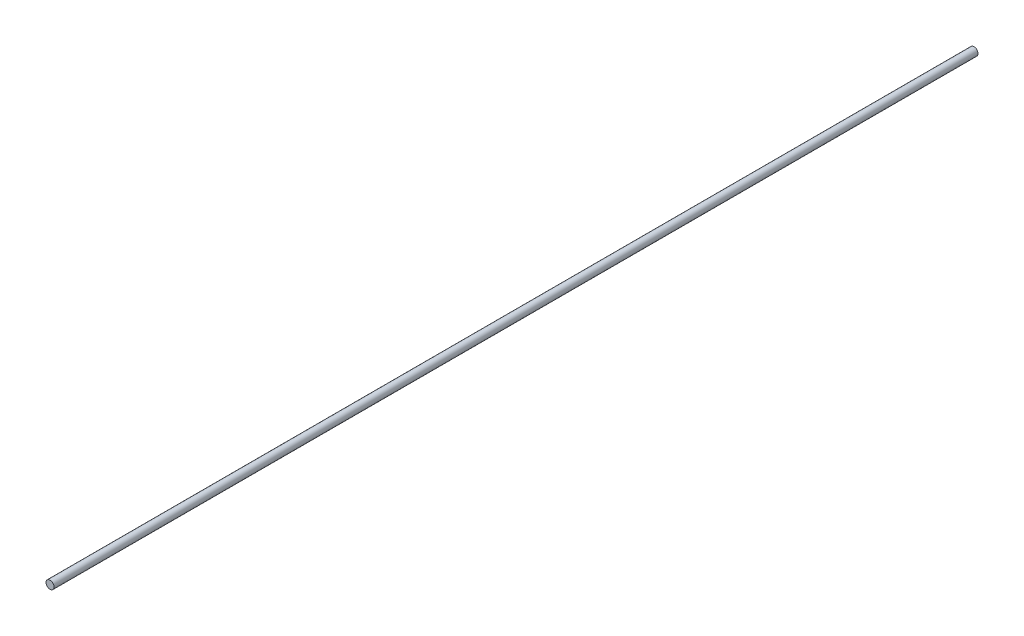
ISO-10303-21;
HEADER;
FILE_DESCRIPTION(('STEP AP214'),'2;1');
FILE_NAME('part.step','',(''),(''),'','','');
FILE_SCHEMA(('AUTOMOTIVE_DESIGN { 1 0 10303 214 1 1 1 1 }'));
ENDSEC;
DATA;
#1=APPLICATION_CONTEXT('core data for automotive mechanical design processes');
#2=APPLICATION_PROTOCOL_DEFINITION('international standard','automotive_design',2000,#1);
#3=PRODUCT_CONTEXT('',#1,'mechanical');
#4=PRODUCT('Part','Part','',(#3));
#5=PRODUCT_RELATED_PRODUCT_CATEGORY('part','',(#4));
#6=PRODUCT_DEFINITION_FORMATION('','',#4);
#7=PRODUCT_DEFINITION_CONTEXT('part definition',#1,'design');
#8=PRODUCT_DEFINITION('design','',#6,#7);
#9=PRODUCT_DEFINITION_SHAPE('','',#8);
#10=(LENGTH_UNIT() NAMED_UNIT(*) SI_UNIT(.MILLI.,.METRE.));
#11=(NAMED_UNIT(*) PLANE_ANGLE_UNIT() SI_UNIT($,.RADIAN.));
#12=(NAMED_UNIT(*) SI_UNIT($,.STERADIAN.) SOLID_ANGLE_UNIT());
#13=UNCERTAINTY_MEASURE_WITH_UNIT(LENGTH_MEASURE(1.E-05),#10,'distance_accuracy_value','');
#14=(GEOMETRIC_REPRESENTATION_CONTEXT(3) GLOBAL_UNCERTAINTY_ASSIGNED_CONTEXT((#13)) GLOBAL_UNIT_ASSIGNED_CONTEXT((#10,
#11,#12)) REPRESENTATION_CONTEXT('',''));
#15=CARTESIAN_POINT('',(0.,0.,0.));
#16=DIRECTION('',(0.,0.,1.));
#17=DIRECTION('',(1.,0.,0.));
#18=AXIS2_PLACEMENT_3D('',#15,#16,#17);
#19=CARTESIAN_POINT('',(0.,0.,914.4));
#20=DIRECTION('',(0.,0.,-1.));
#21=DIRECTION('',(-1.,0.,0.));
#22=AXIS2_PLACEMENT_3D('',#19,#20,#21);
#23=CYLINDRICAL_SURFACE('',#22,7.9375);
#24=CARTESIAN_POINT('',(0.,0.,914.4));
#25=DIRECTION('',(0.,0.,1.));
#26=DIRECTION('',(1.,0.,0.));
#27=AXIS2_PLACEMENT_3D('',#24,#25,#26);
#28=CIRCLE('',#27,7.9375);
#29=CARTESIAN_POINT('',(7.9375,0.,914.4));
#30=VERTEX_POINT('',#29);
#31=EDGE_CURVE('E10',#30,#30,#28,.T.);
#32=ORIENTED_EDGE('',*,*,#31,.F.);
#33=EDGE_LOOP('',(#32));
#34=FACE_BOUND('',#33,.T.);
#35=CARTESIAN_POINT('',(0.,0.,-914.4));
#36=DIRECTION('',(0.,0.,1.));
#37=DIRECTION('',(1.,0.,0.));
#38=AXIS2_PLACEMENT_3D('',#35,#36,#37);
#39=CIRCLE('',#38,7.9375);
#40=CARTESIAN_POINT('',(7.9375,0.,-914.4));
#41=VERTEX_POINT('',#40);
#42=EDGE_CURVE('E34',#41,#41,#39,.T.);
#43=ORIENTED_EDGE('',*,*,#42,.T.);
#44=EDGE_LOOP('',(#43));
#45=FACE_BOUND('',#44,.T.);
#46=ADVANCED_FACE('F31',(#34,#45),#23,.T.);
#47=CARTESIAN_POINT('',(0.,0.,914.4));
#48=DIRECTION('',(0.,0.,1.));
#49=DIRECTION('',(1.,0.,0.));
#50=AXIS2_PLACEMENT_3D('',#47,#48,#49);
#51=PLANE('',#50);
#52=ORIENTED_EDGE('',*,*,#31,.T.);
#53=EDGE_LOOP('',(#52));
#54=FACE_BOUND('',#53,.T.);
#55=ADVANCED_FACE('F46',(#54),#51,.T.);
#56=CARTESIAN_POINT('',(0.,0.,-914.4));
#57=DIRECTION('',(0.,0.,1.));
#58=DIRECTION('',(1.,0.,0.));
#59=AXIS2_PLACEMENT_3D('',#56,#57,#58);
#60=PLANE('',#59);
#61=ORIENTED_EDGE('',*,*,#42,.F.);
#62=EDGE_LOOP('',(#61));
#63=FACE_BOUND('',#62,.T.);
#64=ADVANCED_FACE('F44',(#63),#60,.F.);
#65=CLOSED_SHELL('',(#46,#55,#64));
#66=MANIFOLD_SOLID_BREP('B2',#65);
#67=ADVANCED_BREP_SHAPE_REPRESENTATION('',(#18,#66),#14);
#68=SHAPE_DEFINITION_REPRESENTATION(#9,#67);
ENDSEC;
END-ISO-10303-21;
